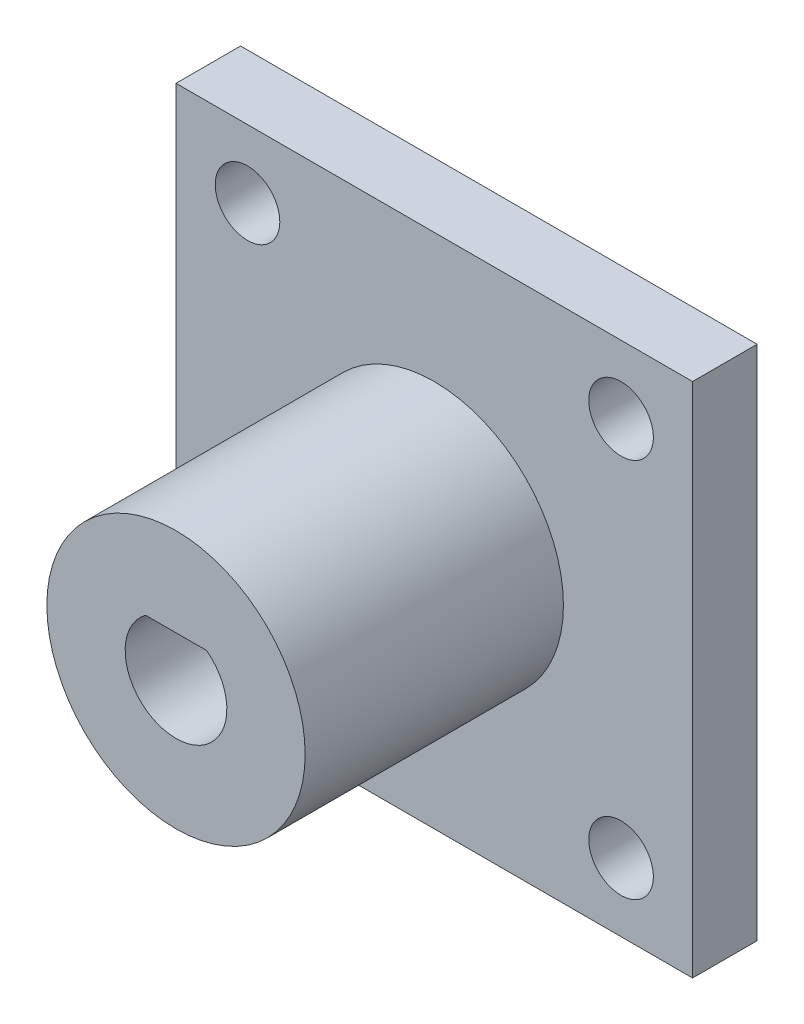
ISO-10303-21;
HEADER;
FILE_DESCRIPTION(('STEP AP214'),'2;1');
FILE_NAME('part.step','',(''),(''),'','','');
FILE_SCHEMA(('AUTOMOTIVE_DESIGN { 1 0 10303 214 1 1 1 1 }'));
ENDSEC;
DATA;
#1=APPLICATION_CONTEXT('core data for automotive mechanical design processes');
#2=APPLICATION_PROTOCOL_DEFINITION('international standard','automotive_design',2000,#1);
#3=PRODUCT_CONTEXT('',#1,'mechanical');
#4=PRODUCT('Part','Part','',(#3));
#5=PRODUCT_RELATED_PRODUCT_CATEGORY('part','',(#4));
#6=PRODUCT_DEFINITION_FORMATION('','',#4);
#7=PRODUCT_DEFINITION_CONTEXT('part definition',#1,'design');
#8=PRODUCT_DEFINITION('design','',#6,#7);
#9=PRODUCT_DEFINITION_SHAPE('','',#8);
#10=(LENGTH_UNIT() NAMED_UNIT(*) SI_UNIT(.MILLI.,.METRE.));
#11=(NAMED_UNIT(*) PLANE_ANGLE_UNIT() SI_UNIT($,.RADIAN.));
#12=(NAMED_UNIT(*) SI_UNIT($,.STERADIAN.) SOLID_ANGLE_UNIT());
#13=UNCERTAINTY_MEASURE_WITH_UNIT(LENGTH_MEASURE(1.E-05),#10,'distance_accuracy_value','');
#14=(GEOMETRIC_REPRESENTATION_CONTEXT(3) GLOBAL_UNCERTAINTY_ASSIGNED_CONTEXT((#13)) GLOBAL_UNIT_ASSIGNED_CONTEXT((#10,
#11,#12)) REPRESENTATION_CONTEXT('',''));
#15=CARTESIAN_POINT('',(0.,0.,0.));
#16=DIRECTION('',(0.,0.,1.));
#17=DIRECTION('',(1.,0.,0.));
#18=AXIS2_PLACEMENT_3D('',#15,#16,#17);
#19=CARTESIAN_POINT('',(25.4,-25.4,6.35));
#20=DIRECTION('',(-1.,0.,0.));
#21=DIRECTION('',(0.,0.,1.));
#22=AXIS2_PLACEMENT_3D('',#19,#20,#21);
#23=PLANE('',#22);
#24=DIRECTION('',(0.,1.,0.));
#25=VECTOR('',#24,1.);
#26=CARTESIAN_POINT('',(25.4,-25.4,0.));
#27=LINE('',#26,#25);
#28=CARTESIAN_POINT('',(25.4,-25.4,0.));
#29=VERTEX_POINT('',#28);
#30=CARTESIAN_POINT('',(25.4,25.4,0.));
#31=VERTEX_POINT('',#30);
#32=EDGE_CURVE('E108',#29,#31,#27,.T.);
#33=ORIENTED_EDGE('',*,*,#32,.T.);
#34=DIRECTION('',(0.,0.,-1.));
#35=VECTOR('',#34,1.);
#36=CARTESIAN_POINT('',(25.4,25.4,6.35));
#37=LINE('',#36,#35);
#38=CARTESIAN_POINT('',(25.4,25.4,6.35));
#39=VERTEX_POINT('',#38);
#40=EDGE_CURVE('E12',#39,#31,#37,.T.);
#41=ORIENTED_EDGE('',*,*,#40,.F.);
#42=DIRECTION('',(0.,1.,0.));
#43=VECTOR('',#42,1.);
#44=CARTESIAN_POINT('',(25.4,-25.4,6.35));
#45=LINE('',#44,#43);
#46=CARTESIAN_POINT('',(25.4,-25.4,6.35));
#47=VERTEX_POINT('',#46);
#48=EDGE_CURVE('E96',#47,#39,#45,.T.);
#49=ORIENTED_EDGE('',*,*,#48,.F.);
#50=DIRECTION('',(0.,0.,-1.));
#51=VECTOR('',#50,1.);
#52=CARTESIAN_POINT('',(25.4,-25.4,6.35));
#53=LINE('',#52,#51);
#54=EDGE_CURVE('E104',#47,#29,#53,.T.);
#55=ORIENTED_EDGE('',*,*,#54,.T.);
#56=EDGE_LOOP('',(#33,#41,#49,#55));
#57=FACE_BOUND('',#56,.T.);
#58=ADVANCED_FACE('F45',(#57),#23,.F.);
#59=CARTESIAN_POINT('',(-25.4,25.4,6.35));
#60=DIRECTION('',(0.,-1.,0.));
#61=DIRECTION('',(0.,0.,-1.));
#62=AXIS2_PLACEMENT_3D('',#59,#60,#61);
#63=PLANE('',#62);
#64=DIRECTION('',(-1.,0.,0.));
#65=VECTOR('',#64,1.);
#66=CARTESIAN_POINT('',(-25.4,25.4,0.));
#67=LINE('',#66,#65);
#68=CARTESIAN_POINT('',(-25.4,25.4,0.));
#69=VERTEX_POINT('',#68);
#70=EDGE_CURVE('E100',#31,#69,#67,.T.);
#71=ORIENTED_EDGE('',*,*,#70,.T.);
#72=DIRECTION('',(0.,0.,-1.));
#73=VECTOR('',#72,1.);
#74=CARTESIAN_POINT('',(-25.4,25.4,6.35));
#75=LINE('',#74,#73);
#76=CARTESIAN_POINT('',(-25.4,25.4,6.35));
#77=VERTEX_POINT('',#76);
#78=EDGE_CURVE('E53',#77,#69,#75,.T.);
#79=ORIENTED_EDGE('',*,*,#78,.F.);
#80=DIRECTION('',(-1.,0.,0.));
#81=VECTOR('',#80,1.);
#82=CARTESIAN_POINT('',(-25.4,25.4,6.35));
#83=LINE('',#82,#81);
#84=EDGE_CURVE('E91',#39,#77,#83,.T.);
#85=ORIENTED_EDGE('',*,*,#84,.F.);
#86=ORIENTED_EDGE('',*,*,#40,.T.);
#87=EDGE_LOOP('',(#71,#79,#85,#86));
#88=FACE_BOUND('',#87,.T.);
#89=ADVANCED_FACE('F99',(#88),#63,.F.);
#90=CARTESIAN_POINT('',(-25.4,-25.4,6.35));
#91=DIRECTION('',(1.,0.,0.));
#92=DIRECTION('',(0.,0.,-1.));
#93=AXIS2_PLACEMENT_3D('',#90,#91,#92);
#94=PLANE('',#93);
#95=DIRECTION('',(0.,-1.,0.));
#96=VECTOR('',#95,1.);
#97=CARTESIAN_POINT('',(-25.4,-25.4,0.));
#98=LINE('',#97,#96);
#99=CARTESIAN_POINT('',(-25.4,-25.4,0.));
#100=VERTEX_POINT('',#99);
#101=EDGE_CURVE('E78',#69,#100,#98,.T.);
#102=ORIENTED_EDGE('',*,*,#101,.T.);
#103=DIRECTION('',(0.,0.,-1.));
#104=VECTOR('',#103,1.);
#105=CARTESIAN_POINT('',(-25.4,-25.4,6.35));
#106=LINE('',#105,#104);
#107=CARTESIAN_POINT('',(-25.4,-25.4,6.35));
#108=VERTEX_POINT('',#107);
#109=EDGE_CURVE('E101',#108,#100,#106,.T.);
#110=ORIENTED_EDGE('',*,*,#109,.F.);
#111=DIRECTION('',(0.,-1.,0.));
#112=VECTOR('',#111,1.);
#113=CARTESIAN_POINT('',(-25.4,-25.4,6.35));
#114=LINE('',#113,#112);
#115=EDGE_CURVE('E94',#77,#108,#114,.T.);
#116=ORIENTED_EDGE('',*,*,#115,.F.);
#117=ORIENTED_EDGE('',*,*,#78,.T.);
#118=EDGE_LOOP('',(#102,#110,#116,#117));
#119=FACE_BOUND('',#118,.T.);
#120=ADVANCED_FACE('F102',(#119),#94,.F.);
#121=CARTESIAN_POINT('',(-25.4,-25.4,6.35));
#122=DIRECTION('',(0.,1.,0.));
#123=DIRECTION('',(0.,0.,1.));
#124=AXIS2_PLACEMENT_3D('',#121,#122,#123);
#125=PLANE('',#124);
#126=DIRECTION('',(1.,0.,0.));
#127=VECTOR('',#126,1.);
#128=CARTESIAN_POINT('',(-25.4,-25.4,0.));
#129=LINE('',#128,#127);
#130=EDGE_CURVE('E84',#100,#29,#129,.T.);
#131=ORIENTED_EDGE('',*,*,#130,.T.);
#132=ORIENTED_EDGE('',*,*,#54,.F.);
#133=DIRECTION('',(1.,0.,0.));
#134=VECTOR('',#133,1.);
#135=CARTESIAN_POINT('',(-25.4,-25.4,6.35));
#136=LINE('',#135,#134);
#137=EDGE_CURVE('E61',#108,#47,#136,.T.);
#138=ORIENTED_EDGE('',*,*,#137,.F.);
#139=ORIENTED_EDGE('',*,*,#109,.T.);
#140=EDGE_LOOP('',(#131,#132,#138,#139));
#141=FACE_BOUND('',#140,.T.);
#142=ADVANCED_FACE('F116',(#141),#125,.F.);
#143=CARTESIAN_POINT('',(0.,0.,6.35));
#144=DIRECTION('',(0.,0.,-1.));
#145=DIRECTION('',(-1.,0.,0.));
#146=AXIS2_PLACEMENT_3D('',#143,#144,#145);
#147=PLANE('',#146);
#148=CARTESIAN_POINT('',(18.3669245367535,-18.7048168015474,6.35));
#149=DIRECTION('',(0.,0.,1.));
#150=DIRECTION('',(-1.,0.,0.));
#151=AXIS2_PLACEMENT_3D('',#148,#149,#150);
#152=CIRCLE('',#151,3.175);
#153=CARTESIAN_POINT('',(15.1919245367535,-18.7048168015474,6.35));
#154=VERTEX_POINT('',#153);
#155=EDGE_CURVE('E137',#154,#154,#152,.T.);
#156=ORIENTED_EDGE('',*,*,#155,.F.);
#157=EDGE_LOOP('',(#156));
#158=FACE_BOUND('',#157,.T.);
#159=CARTESIAN_POINT('',(-18.3669245367535,-18.7048168015474,6.35));
#160=DIRECTION('',(0.,0.,-1.));
#161=DIRECTION('',(1.,0.,0.));
#162=AXIS2_PLACEMENT_3D('',#159,#160,#161);
#163=CIRCLE('',#162,3.175);
#164=CARTESIAN_POINT('',(-15.1919245367535,-18.7048168015474,6.35));
#165=VERTEX_POINT('',#164);
#166=EDGE_CURVE('E131',#165,#165,#163,.T.);
#167=ORIENTED_EDGE('',*,*,#166,.T.);
#168=EDGE_LOOP('',(#167));
#169=FACE_BOUND('',#168,.T.);
#170=CARTESIAN_POINT('',(-18.3669245367535,18.7048168015474,6.35));
#171=DIRECTION('',(0.,0.,1.));
#172=DIRECTION('',(1.,0.,0.));
#173=AXIS2_PLACEMENT_3D('',#170,#171,#172);
#174=CIRCLE('',#173,3.175);
#175=CARTESIAN_POINT('',(-15.1919245367535,18.7048168015474,6.35));
#176=VERTEX_POINT('',#175);
#177=EDGE_CURVE('E127',#176,#176,#174,.T.);
#178=ORIENTED_EDGE('',*,*,#177,.F.);
#179=EDGE_LOOP('',(#178));
#180=FACE_BOUND('',#179,.T.);
#181=CARTESIAN_POINT('',(18.3669245367535,18.7048168015474,6.35));
#182=DIRECTION('',(0.,0.,-1.));
#183=DIRECTION('',(-1.,0.,0.));
#184=AXIS2_PLACEMENT_3D('',#181,#182,#183);
#185=CIRCLE('',#184,3.175);
#186=CARTESIAN_POINT('',(15.1919245367535,18.7048168015474,6.35));
#187=VERTEX_POINT('',#186);
#188=EDGE_CURVE('E111',#187,#187,#185,.T.);
#189=ORIENTED_EDGE('',*,*,#188,.T.);
#190=EDGE_LOOP('',(#189));
#191=FACE_BOUND('',#190,.T.);
#192=ORIENTED_EDGE('',*,*,#48,.T.);
#193=ORIENTED_EDGE('',*,*,#84,.T.);
#194=ORIENTED_EDGE('',*,*,#115,.T.);
#195=ORIENTED_EDGE('',*,*,#137,.T.);
#196=EDGE_LOOP('',(#192,#193,#194,#195));
#197=FACE_BOUND('',#196,.T.);
#198=ADVANCED_FACE('F92',(#158,#169,#180,#191,#197),#147,.F.);
#199=CARTESIAN_POINT('',(0.,0.,0.));
#200=DIRECTION('',(0.,0.,-1.));
#201=DIRECTION('',(-1.,0.,0.));
#202=AXIS2_PLACEMENT_3D('',#199,#200,#201);
#203=PLANE('',#202);
#204=CARTESIAN_POINT('',(18.3669245367535,-18.7048168015474,0.));
#205=DIRECTION('',(0.,0.,1.));
#206=DIRECTION('',(-1.,0.,0.));
#207=AXIS2_PLACEMENT_3D('',#204,#205,#206);
#208=CIRCLE('',#207,3.175);
#209=CARTESIAN_POINT('',(15.1919245367535,-18.7048168015474,0.));
#210=VERTEX_POINT('',#209);
#211=EDGE_CURVE('E140',#210,#210,#208,.T.);
#212=ORIENTED_EDGE('',*,*,#211,.T.);
#213=EDGE_LOOP('',(#212));
#214=FACE_BOUND('',#213,.T.);
#215=CARTESIAN_POINT('',(-18.3669245367535,-18.7048168015474,0.));
#216=DIRECTION('',(0.,0.,-1.));
#217=DIRECTION('',(1.,0.,0.));
#218=AXIS2_PLACEMENT_3D('',#215,#216,#217);
#219=CIRCLE('',#218,3.175);
#220=CARTESIAN_POINT('',(-15.1919245367535,-18.7048168015474,0.));
#221=VERTEX_POINT('',#220);
#222=EDGE_CURVE('E134',#221,#221,#219,.T.);
#223=ORIENTED_EDGE('',*,*,#222,.F.);
#224=EDGE_LOOP('',(#223));
#225=FACE_BOUND('',#224,.T.);
#226=CARTESIAN_POINT('',(-18.3669245367535,18.7048168015474,0.));
#227=DIRECTION('',(0.,0.,1.));
#228=DIRECTION('',(1.,0.,0.));
#229=AXIS2_PLACEMENT_3D('',#226,#227,#228);
#230=CIRCLE('',#229,3.175);
#231=CARTESIAN_POINT('',(-15.1919245367535,18.7048168015474,0.));
#232=VERTEX_POINT('',#231);
#233=EDGE_CURVE('E128',#232,#232,#230,.T.);
#234=ORIENTED_EDGE('',*,*,#233,.T.);
#235=EDGE_LOOP('',(#234));
#236=FACE_BOUND('',#235,.T.);
#237=CARTESIAN_POINT('',(18.3669245367535,18.7048168015474,0.));
#238=DIRECTION('',(0.,0.,-1.));
#239=DIRECTION('',(-1.,0.,0.));
#240=AXIS2_PLACEMENT_3D('',#237,#238,#239);
#241=CIRCLE('',#240,3.175);
#242=CARTESIAN_POINT('',(15.1919245367535,18.7048168015474,0.));
#243=VERTEX_POINT('',#242);
#244=EDGE_CURVE('E124',#243,#243,#241,.T.);
#245=ORIENTED_EDGE('',*,*,#244,.F.);
#246=EDGE_LOOP('',(#245));
#247=FACE_BOUND('',#246,.T.);
#248=ORIENTED_EDGE('',*,*,#32,.F.);
#249=ORIENTED_EDGE('',*,*,#130,.F.);
#250=ORIENTED_EDGE('',*,*,#101,.F.);
#251=ORIENTED_EDGE('',*,*,#70,.F.);
#252=EDGE_LOOP('',(#248,#249,#250,#251));
#253=FACE_BOUND('',#252,.T.);
#254=ADVANCED_FACE('F119',(#214,#225,#236,#247,#253),#203,.T.);
#255=CARTESIAN_POINT('',(18.3669245367535,18.7048168015474,31.75));
#256=DIRECTION('',(0.,0.,-1.));
#257=DIRECTION('',(-1.,0.,0.));
#258=AXIS2_PLACEMENT_3D('',#255,#256,#257);
#259=CYLINDRICAL_SURFACE('',#258,3.175);
#260=ORIENTED_EDGE('',*,*,#244,.T.);
#261=EDGE_LOOP('',(#260));
#262=FACE_BOUND('',#261,.T.);
#263=ORIENTED_EDGE('',*,*,#188,.F.);
#264=EDGE_LOOP('',(#263));
#265=FACE_BOUND('',#264,.T.);
#266=ADVANCED_FACE('F158',(#262,#265),#259,.F.);
#267=CARTESIAN_POINT('',(-18.3669245367535,18.7048168015474,6.35));
#268=DIRECTION('',(0.,0.,-1.));
#269=DIRECTION('',(-1.,0.,0.));
#270=AXIS2_PLACEMENT_3D('',#267,#268,#269);
#271=CYLINDRICAL_SURFACE('',#270,3.175);
#272=ORIENTED_EDGE('',*,*,#177,.T.);
#273=EDGE_LOOP('',(#272));
#274=FACE_BOUND('',#273,.T.);
#275=ORIENTED_EDGE('',*,*,#233,.F.);
#276=EDGE_LOOP('',(#275));
#277=FACE_BOUND('',#276,.T.);
#278=ADVANCED_FACE('F160',(#274,#277),#271,.F.);
#279=CARTESIAN_POINT('',(-18.3669245367535,-18.7048168015474,6.35));
#280=DIRECTION('',(0.,0.,-1.));
#281=DIRECTION('',(-1.,0.,0.));
#282=AXIS2_PLACEMENT_3D('',#279,#280,#281);
#283=CYLINDRICAL_SURFACE('',#282,3.175);
#284=ORIENTED_EDGE('',*,*,#166,.F.);
#285=EDGE_LOOP('',(#284));
#286=FACE_BOUND('',#285,.T.);
#287=ORIENTED_EDGE('',*,*,#222,.T.);
#288=EDGE_LOOP('',(#287));
#289=FACE_BOUND('',#288,.T.);
#290=ADVANCED_FACE('F167',(#286,#289),#283,.F.);
#291=CARTESIAN_POINT('',(18.3669245367535,-18.7048168015474,6.35));
#292=DIRECTION('',(0.,0.,-1.));
#293=DIRECTION('',(-1.,0.,0.));
#294=AXIS2_PLACEMENT_3D('',#291,#292,#293);
#295=CYLINDRICAL_SURFACE('',#294,3.175);
#296=ORIENTED_EDGE('',*,*,#155,.T.);
#297=EDGE_LOOP('',(#296));
#298=FACE_BOUND('',#297,.T.);
#299=ORIENTED_EDGE('',*,*,#211,.F.);
#300=EDGE_LOOP('',(#299));
#301=FACE_BOUND('',#300,.T.);
#302=ADVANCED_FACE('F146',(#298,#301),#295,.F.);
#303=CLOSED_SHELL('',(#58,#89,#120,#142,#198,#254,#266,#278,#290,#302));
#304=MANIFOLD_SOLID_BREP('B2',#303);
#305=CARTESIAN_POINT('',(0.,0.,31.75));
#306=DIRECTION('',(0.,0.,1.));
#307=DIRECTION('',(1.,0.,0.));
#308=AXIS2_PLACEMENT_3D('',#305,#306,#307);
#309=PLANE('',#308);
#310=CARTESIAN_POINT('',(0.,0.,31.75));
#311=DIRECTION('',(0.,0.,1.));
#312=DIRECTION('',(1.,0.,0.));
#313=AXIS2_PLACEMENT_3D('',#310,#311,#312);
#314=CIRCLE('',#313,12.7);
#315=CARTESIAN_POINT('',(12.7,0.,31.75));
#316=VERTEX_POINT('',#315);
#317=EDGE_CURVE('E43',#316,#316,#314,.T.);
#318=ORIENTED_EDGE('',*,*,#317,.T.);
#319=EDGE_LOOP('',(#318));
#320=FACE_BOUND('',#319,.T.);
#321=DIRECTION('',(-1.,0.,0.));
#322=VECTOR('',#321,1.);
#323=CARTESIAN_POINT('',(-3.00000001133333,3.999999874,31.75));
#324=LINE('',#323,#322);
#325=CARTESIAN_POINT('',(3.00000001133333,3.999999874,31.75));
#326=VERTEX_POINT('',#325);
#327=CARTESIAN_POINT('',(-3.00000001133333,3.999999874,31.75));
#328=VERTEX_POINT('',#327);
#329=EDGE_CURVE('E294',#326,#328,#324,.T.);
#330=ORIENTED_EDGE('',*,*,#329,.F.);
#331=CARTESIAN_POINT('',(0.,0.,31.75));
#332=DIRECTION('',(0.,0.,1.));
#333=DIRECTION('',(1.,0.,0.));
#334=AXIS2_PLACEMENT_3D('',#331,#332,#333);
#335=CIRCLE('',#334,4.999999906);
#336=EDGE_CURVE('E285',#328,#326,#335,.T.);
#337=ORIENTED_EDGE('',*,*,#336,.F.);
#338=EDGE_LOOP('',(#330,#337));
#339=FACE_BOUND('',#338,.T.);
#340=ADVANCED_FACE('F253',(#320,#339),#309,.T.);
#341=CARTESIAN_POINT('',(0.,0.,0.));
#342=DIRECTION('',(0.,0.,1.));
#343=DIRECTION('',(1.,0.,0.));
#344=AXIS2_PLACEMENT_3D('',#341,#342,#343);
#345=PLANE('',#344);
#346=CARTESIAN_POINT('',(0.,0.,0.));
#347=DIRECTION('',(0.,0.,1.));
#348=DIRECTION('',(1.,0.,0.));
#349=AXIS2_PLACEMENT_3D('',#346,#347,#348);
#350=CIRCLE('',#349,12.7);
#351=CARTESIAN_POINT('',(12.7,0.,0.));
#352=VERTEX_POINT('',#351);
#353=EDGE_CURVE('E257',#352,#352,#350,.T.);
#354=ORIENTED_EDGE('',*,*,#353,.F.);
#355=EDGE_LOOP('',(#354));
#356=FACE_BOUND('',#355,.T.);
#357=CARTESIAN_POINT('',(0.,0.,0.));
#358=DIRECTION('',(0.,0.,1.));
#359=DIRECTION('',(1.,0.,0.));
#360=AXIS2_PLACEMENT_3D('',#357,#358,#359);
#361=CIRCLE('',#360,4.999999906);
#362=CARTESIAN_POINT('',(-3.00000001133333,3.999999874,0.));
#363=VERTEX_POINT('',#362);
#364=CARTESIAN_POINT('',(3.00000001133333,3.999999874,0.));
#365=VERTEX_POINT('',#364);
#366=EDGE_CURVE('E275',#363,#365,#361,.T.);
#367=ORIENTED_EDGE('',*,*,#366,.T.);
#368=DIRECTION('',(-1.,0.,0.));
#369=VECTOR('',#368,1.);
#370=CARTESIAN_POINT('',(-3.00000001133333,3.999999874,0.));
#371=LINE('',#370,#369);
#372=EDGE_CURVE('E281',#365,#363,#371,.T.);
#373=ORIENTED_EDGE('',*,*,#372,.T.);
#374=EDGE_LOOP('',(#367,#373));
#375=FACE_BOUND('',#374,.T.);
#376=ADVANCED_FACE('F291',(#356,#375),#345,.F.);
#377=CARTESIAN_POINT('',(0.,0.,31.75));
#378=DIRECTION('',(0.,0.,-1.));
#379=DIRECTION('',(-1.,0.,0.));
#380=AXIS2_PLACEMENT_3D('',#377,#378,#379);
#381=CYLINDRICAL_SURFACE('',#380,12.7);
#382=ORIENTED_EDGE('',*,*,#317,.F.);
#383=EDGE_LOOP('',(#382));
#384=FACE_BOUND('',#383,.T.);
#385=ORIENTED_EDGE('',*,*,#353,.T.);
#386=EDGE_LOOP('',(#385));
#387=FACE_BOUND('',#386,.T.);
#388=ADVANCED_FACE('F255',(#384,#387),#381,.T.);
#389=CARTESIAN_POINT('',(0.,0.,31.75));
#390=DIRECTION('',(0.,0.,-1.));
#391=DIRECTION('',(-1.,0.,0.));
#392=AXIS2_PLACEMENT_3D('',#389,#390,#391);
#393=CYLINDRICAL_SURFACE('',#392,4.999999906);
#394=ORIENTED_EDGE('',*,*,#366,.F.);
#395=DIRECTION('',(0.,0.,-1.));
#396=VECTOR('',#395,1.);
#397=CARTESIAN_POINT('',(-3.00000001133333,3.999999874,31.75));
#398=LINE('',#397,#396);
#399=EDGE_CURVE('E283',#328,#363,#398,.T.);
#400=ORIENTED_EDGE('',*,*,#399,.F.);
#401=ORIENTED_EDGE('',*,*,#336,.T.);
#402=DIRECTION('',(0.,0.,-1.));
#403=VECTOR('',#402,1.);
#404=CARTESIAN_POINT('',(3.00000001133333,3.999999874,31.75));
#405=LINE('',#404,#403);
#406=EDGE_CURVE('E268',#326,#365,#405,.T.);
#407=ORIENTED_EDGE('',*,*,#406,.T.);
#408=EDGE_LOOP('',(#394,#400,#401,#407));
#409=FACE_BOUND('',#408,.T.);
#410=ADVANCED_FACE('F287',(#409),#393,.F.);
#411=CARTESIAN_POINT('',(-3.00000001133333,3.999999874,31.75));
#412=DIRECTION('',(0.,-1.,0.));
#413=DIRECTION('',(0.,0.,-1.));
#414=AXIS2_PLACEMENT_3D('',#411,#412,#413);
#415=PLANE('',#414);
#416=ORIENTED_EDGE('',*,*,#372,.F.);
#417=ORIENTED_EDGE('',*,*,#406,.F.);
#418=ORIENTED_EDGE('',*,*,#329,.T.);
#419=ORIENTED_EDGE('',*,*,#399,.T.);
#420=EDGE_LOOP('',(#416,#417,#418,#419));
#421=FACE_BOUND('',#420,.T.);
#422=ADVANCED_FACE('F282',(#421),#415,.T.);
#423=CLOSED_SHELL('',(#340,#376,#388,#410,#422));
#424=MANIFOLD_SOLID_BREP('B6',#423);
#425=ADVANCED_BREP_SHAPE_REPRESENTATION('',(#18,#304,#424),#14);
#426=SHAPE_DEFINITION_REPRESENTATION(#9,#425);
ENDSEC;
END-ISO-10303-21;
